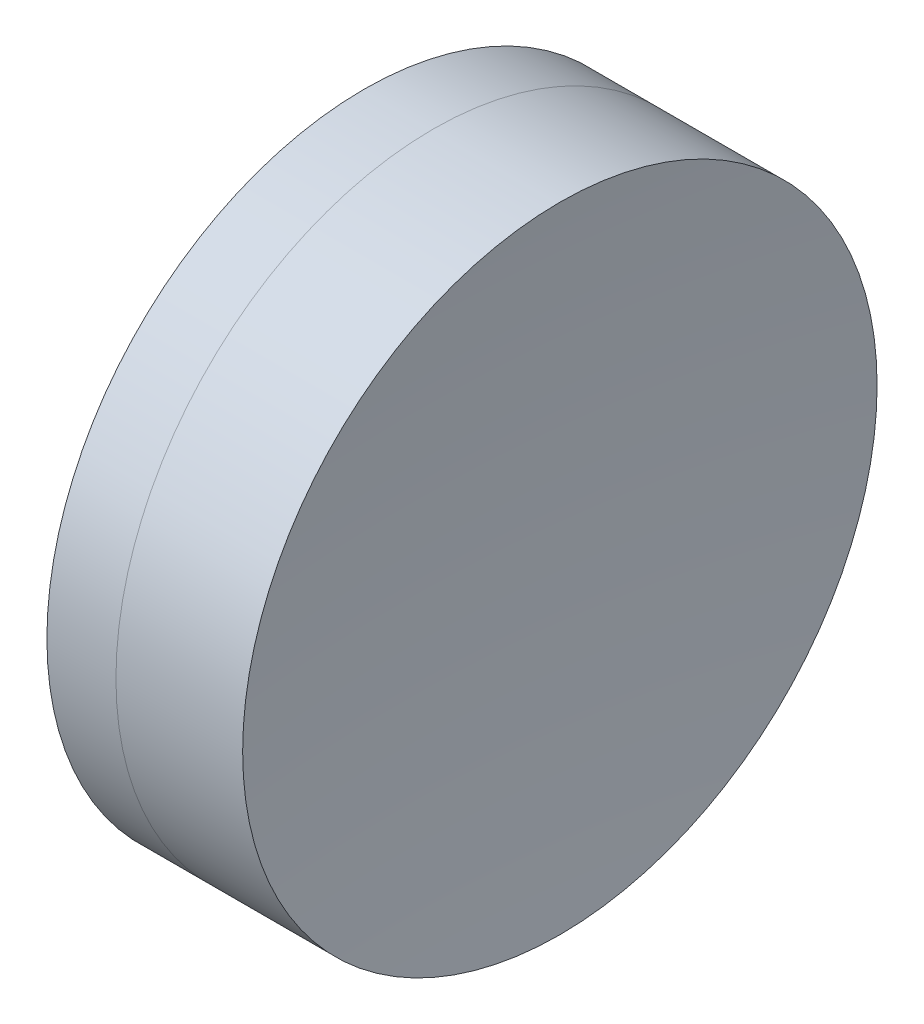
ISO-10303-21;
HEADER;
FILE_DESCRIPTION(('STEP AP214'),'2;1');
FILE_NAME('part.step','',(''),(''),'','','');
FILE_SCHEMA(('AUTOMOTIVE_DESIGN { 1 0 10303 214 1 1 1 1 }'));
ENDSEC;
DATA;
#1=APPLICATION_CONTEXT('core data for automotive mechanical design processes');
#2=APPLICATION_PROTOCOL_DEFINITION('international standard','automotive_design',2000,#1);
#3=PRODUCT_CONTEXT('',#1,'mechanical');
#4=PRODUCT('Part','Part','',(#3));
#5=PRODUCT_RELATED_PRODUCT_CATEGORY('part','',(#4));
#6=PRODUCT_DEFINITION_FORMATION('','',#4);
#7=PRODUCT_DEFINITION_CONTEXT('part definition',#1,'design');
#8=PRODUCT_DEFINITION('design','',#6,#7);
#9=PRODUCT_DEFINITION_SHAPE('','',#8);
#10=(LENGTH_UNIT() NAMED_UNIT(*) SI_UNIT(.MILLI.,.METRE.));
#11=(NAMED_UNIT(*) PLANE_ANGLE_UNIT() SI_UNIT($,.RADIAN.));
#12=(NAMED_UNIT(*) SI_UNIT($,.STERADIAN.) SOLID_ANGLE_UNIT());
#13=UNCERTAINTY_MEASURE_WITH_UNIT(LENGTH_MEASURE(1.E-05),#10,'distance_accuracy_value','');
#14=(GEOMETRIC_REPRESENTATION_CONTEXT(3) GLOBAL_UNCERTAINTY_ASSIGNED_CONTEXT((#13)) GLOBAL_UNIT_ASSIGNED_CONTEXT((#10,
#11,#12)) REPRESENTATION_CONTEXT('',''));
#15=CARTESIAN_POINT('',(0.,0.,0.));
#16=DIRECTION('',(0.,0.,1.));
#17=DIRECTION('',(1.,0.,0.));
#18=AXIS2_PLACEMENT_3D('',#15,#16,#17);
#19=CARTESIAN_POINT('',(11.4619704724149,0.,0.));
#20=DIRECTION('',(-1.,0.,0.));
#21=DIRECTION('',(0.,0.,-1.));
#22=AXIS2_PLACEMENT_3D('',#19,#20,#21);
#23=SPHERICAL_SURFACE('',#22,27.86);
#24=CARTESIAN_POINT('',(38.5886565951244,0.,0.));
#25=DIRECTION('',(-1.,0.,0.));
#26=DIRECTION('',(0.,0.,1.));
#27=AXIS2_PLACEMENT_3D('',#24,#25,#26);
#28=CIRCLE('',#27,6.34999999999998);
#29=CARTESIAN_POINT('',(38.5886565951244,0.,6.34999999999998));
#30=VERTEX_POINT('',#29);
#31=EDGE_CURVE('E51',#30,#30,#28,.T.);
#32=ORIENTED_EDGE('',*,*,#31,.T.);
#33=EDGE_LOOP('',(#32));
#34=FACE_BOUND('',#33,.T.);
#35=ADVANCED_FACE('F45',(#34),#23,.F.);
#36=CARTESIAN_POINT('',(107.501970472415,0.,0.));
#37=DIRECTION('',(-1.,0.,0.));
#38=DIRECTION('',(0.,0.,-1.));
#39=AXIS2_PLACEMENT_3D('',#36,#37,#38);
#40=SPHERICAL_SURFACE('',#39,66.68);
#41=CARTESIAN_POINT('',(41.1250173938049,0.,0.));
#42=DIRECTION('',(-1.,0.,0.));
#43=DIRECTION('',(0.,0.,1.));
#44=AXIS2_PLACEMENT_3D('',#41,#42,#43);
#45=CIRCLE('',#44,6.34999999999998);
#46=CARTESIAN_POINT('',(41.1250173938049,0.,6.34999999999998));
#47=VERTEX_POINT('',#46);
#48=EDGE_CURVE('E11',#47,#47,#45,.T.);
#49=ORIENTED_EDGE('',*,*,#48,.F.);
#50=EDGE_LOOP('',(#49));
#51=FACE_BOUND('',#50,.T.);
#52=ADVANCED_FACE('F60',(#51),#40,.F.);
#53=CARTESIAN_POINT('',(-0.551919992657797,0.,0.));
#54=DIRECTION('',(-1.,0.,0.));
#55=DIRECTION('',(0.,0.,1.));
#56=AXIS2_PLACEMENT_3D('',#53,#54,#55);
#57=CYLINDRICAL_SURFACE('',#56,6.34999999999998);
#58=ORIENTED_EDGE('',*,*,#48,.T.);
#59=EDGE_LOOP('',(#58));
#60=FACE_BOUND('',#59,.T.);
#61=ORIENTED_EDGE('',*,*,#31,.F.);
#62=EDGE_LOOP('',(#61));
#63=FACE_BOUND('',#62,.T.);
#64=ADVANCED_FACE('F58',(#60,#63),#57,.T.);
#65=CLOSED_SHELL('',(#35,#52,#64));
#66=MANIFOLD_SOLID_BREP('B2',#65);
#67=CARTESIAN_POINT('',(59.5519704724149,0.,0.));
#68=DIRECTION('',(-1.,0.,0.));
#69=DIRECTION('',(0.,0.,-1.));
#70=AXIS2_PLACEMENT_3D('',#67,#68,#69);
#71=SPHERICAL_SURFACE('',#70,23.23);
#72=CARTESIAN_POINT('',(37.2067159426495,0.,0.));
#73=DIRECTION('',(-1.,0.,0.));
#74=DIRECTION('',(0.,0.,1.));
#75=AXIS2_PLACEMENT_3D('',#72,#73,#74);
#76=CIRCLE('',#75,6.35);
#77=CARTESIAN_POINT('',(37.2067159426495,0.,6.35));
#78=VERTEX_POINT('',#77);
#79=EDGE_CURVE('E44',#78,#78,#76,.T.);
#80=ORIENTED_EDGE('',*,*,#79,.T.);
#81=EDGE_LOOP('',(#80));
#82=FACE_BOUND('',#81,.T.);
#83=ADVANCED_FACE('F86',(#82),#71,.T.);
#84=CARTESIAN_POINT('',(-0.816062176165804,0.,0.));
#85=DIRECTION('',(-1.,0.,0.));
#86=DIRECTION('',(0.,0.,1.));
#87=AXIS2_PLACEMENT_3D('',#84,#85,#86);
#88=CYLINDRICAL_SURFACE('',#87,6.35);
#89=CARTESIAN_POINT('',(38.5886565951244,0.,0.));
#90=DIRECTION('',(-1.,0.,0.));
#91=DIRECTION('',(0.,0.,1.));
#92=AXIS2_PLACEMENT_3D('',#89,#90,#91);
#93=CIRCLE('',#92,6.35);
#94=CARTESIAN_POINT('',(38.5886565951244,0.,6.35));
#95=VERTEX_POINT('',#94);
#96=EDGE_CURVE('E92',#95,#95,#93,.T.);
#97=ORIENTED_EDGE('',*,*,#96,.T.);
#98=EDGE_LOOP('',(#97));
#99=FACE_BOUND('',#98,.T.);
#100=ORIENTED_EDGE('',*,*,#79,.F.);
#101=EDGE_LOOP('',(#100));
#102=FACE_BOUND('',#101,.T.);
#103=ADVANCED_FACE('F98',(#99,#102),#88,.T.);
#104=CARTESIAN_POINT('',(11.4619704724149,0.,0.));
#105=DIRECTION('',(-1.,0.,0.));
#106=DIRECTION('',(0.,0.,1.));
#107=AXIS2_PLACEMENT_3D('',#104,#105,#106);
#108=SPHERICAL_SURFACE('',#107,27.86);
#109=ORIENTED_EDGE('',*,*,#96,.F.);
#110=EDGE_LOOP('',(#109));
#111=FACE_BOUND('',#110,.T.);
#112=ADVANCED_FACE('F101',(#111),#108,.T.);
#113=CLOSED_SHELL('',(#83,#103,#112));
#114=MANIFOLD_SOLID_BREP('B6',#113);
#115=ADVANCED_BREP_SHAPE_REPRESENTATION('',(#18,#66,#114),#14);
#116=SHAPE_DEFINITION_REPRESENTATION(#9,#115);
ENDSEC;
END-ISO-10303-21;
